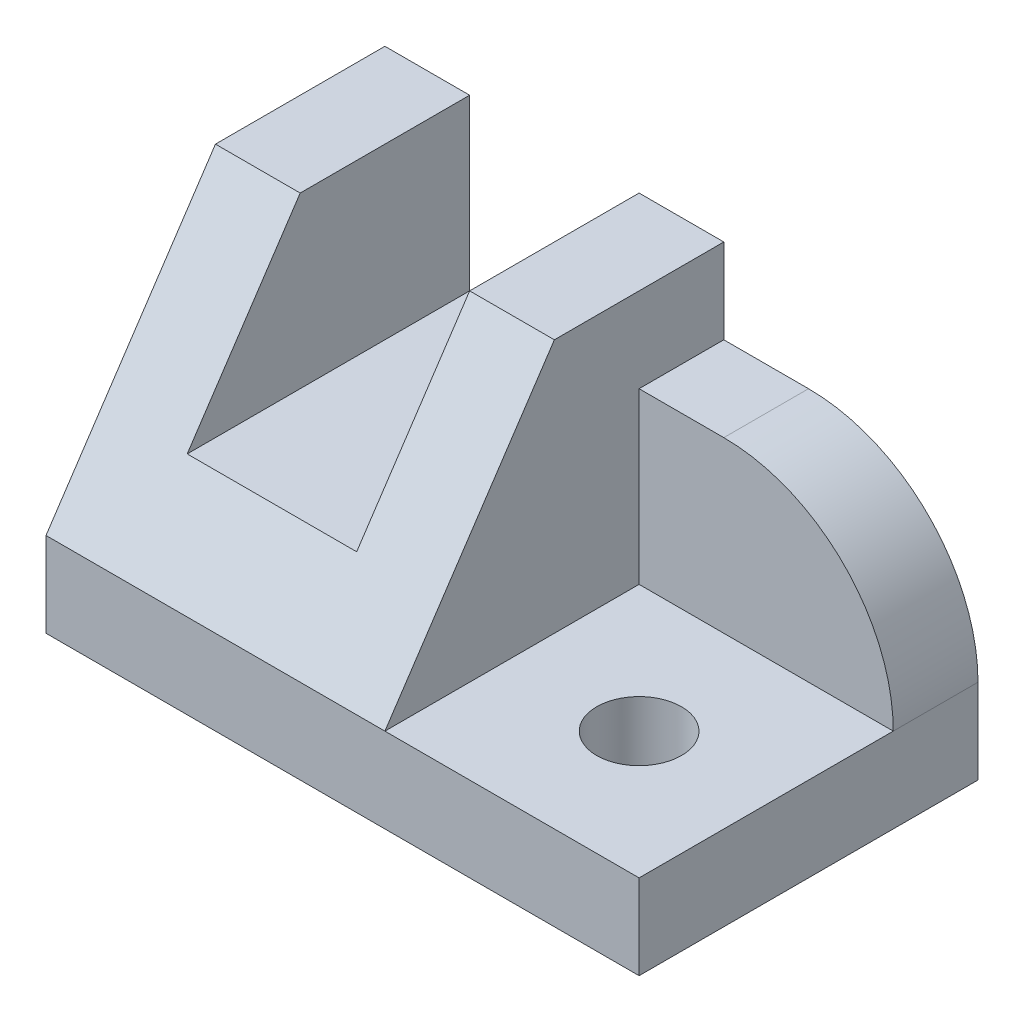
ISO-10303-21;
HEADER;
FILE_DESCRIPTION(('STEP AP214'),'2;1');
FILE_NAME('part.step','',(''),(''),'','','');
FILE_SCHEMA(('AUTOMOTIVE_DESIGN { 1 0 10303 214 1 1 1 1 }'));
ENDSEC;
DATA;
#1=APPLICATION_CONTEXT('core data for automotive mechanical design processes');
#2=APPLICATION_PROTOCOL_DEFINITION('international standard','automotive_design',2000,#1);
#3=PRODUCT_CONTEXT('',#1,'mechanical');
#4=PRODUCT('Part','Part','',(#3));
#5=PRODUCT_RELATED_PRODUCT_CATEGORY('part','',(#4));
#6=PRODUCT_DEFINITION_FORMATION('','',#4);
#7=PRODUCT_DEFINITION_CONTEXT('part definition',#1,'design');
#8=PRODUCT_DEFINITION('design','',#6,#7);
#9=PRODUCT_DEFINITION_SHAPE('','',#8);
#10=(LENGTH_UNIT() NAMED_UNIT(*) SI_UNIT(.MILLI.,.METRE.));
#11=(NAMED_UNIT(*) PLANE_ANGLE_UNIT() SI_UNIT($,.RADIAN.));
#12=(NAMED_UNIT(*) SI_UNIT($,.STERADIAN.) SOLID_ANGLE_UNIT());
#13=UNCERTAINTY_MEASURE_WITH_UNIT(LENGTH_MEASURE(1.E-05),#10,'distance_accuracy_value','');
#14=(GEOMETRIC_REPRESENTATION_CONTEXT(3) GLOBAL_UNCERTAINTY_ASSIGNED_CONTEXT((#13)) GLOBAL_UNIT_ASSIGNED_CONTEXT((#10,
#11,#12)) REPRESENTATION_CONTEXT('',''));
#15=CARTESIAN_POINT('',(0.,0.,0.));
#16=DIRECTION('',(0.,0.,1.));
#17=DIRECTION('',(1.,0.,0.));
#18=AXIS2_PLACEMENT_3D('',#15,#16,#17);
#19=CARTESIAN_POINT('',(40.,40.,-40.));
#20=DIRECTION('',(0.,-1.,0.));
#21=DIRECTION('',(0.,0.,-1.));
#22=AXIS2_PLACEMENT_3D('',#19,#20,#21);
#23=PLANE('',#22);
#24=DIRECTION('',(-1.,0.,0.));
#25=VECTOR('',#24,1.);
#26=CARTESIAN_POINT('',(40.,40.,-20.));
#27=LINE('',#26,#25);
#28=CARTESIAN_POINT('',(9.99999999999998,40.,-20.));
#29=VERTEX_POINT('',#28);
#30=CARTESIAN_POINT('',(0.,40.,-20.));
#31=VERTEX_POINT('',#30);
#32=EDGE_CURVE('E230',#29,#31,#27,.T.);
#33=ORIENTED_EDGE('',*,*,#32,.F.);
#34=DIRECTION('',(0.,0.,-1.));
#35=VECTOR('',#34,1.);
#36=CARTESIAN_POINT('',(9.99999999999998,40.,0.));
#37=LINE('',#36,#35);
#38=CARTESIAN_POINT('',(9.99999999999999,40.,-40.));
#39=VERTEX_POINT('',#38);
#40=EDGE_CURVE('E157',#29,#39,#37,.T.);
#41=ORIENTED_EDGE('',*,*,#40,.T.);
#42=DIRECTION('',(1.,0.,0.));
#43=VECTOR('',#42,1.);
#44=CARTESIAN_POINT('',(40.,40.,-40.));
#45=LINE('',#44,#43);
#46=CARTESIAN_POINT('',(0.,40.,-40.));
#47=VERTEX_POINT('',#46);
#48=EDGE_CURVE('E217',#47,#39,#45,.T.);
#49=ORIENTED_EDGE('',*,*,#48,.F.);
#50=DIRECTION('',(0.,0.,1.));
#51=VECTOR('',#50,1.);
#52=CARTESIAN_POINT('',(0.,40.,-40.));
#53=LINE('',#52,#51);
#54=EDGE_CURVE('E219',#47,#31,#53,.T.);
#55=ORIENTED_EDGE('',*,*,#54,.T.);
#56=EDGE_LOOP('',(#33,#41,#49,#55));
#57=FACE_BOUND('',#56,.T.);
#58=ADVANCED_FACE('F35',(#57),#23,.F.);
#59=CARTESIAN_POINT('',(40.,10.,0.));
#60=DIRECTION('',(0.,0.554700196225229,0.832050294337844));
#61=DIRECTION('',(0.,-0.832050294337844,0.554700196225229));
#62=AXIS2_PLACEMENT_3D('',#59,#60,#61);
#63=PLANE('',#62);
#64=DIRECTION('',(0.,-0.832050294337844,0.554700196225229));
#65=VECTOR('',#64,1.);
#66=CARTESIAN_POINT('',(9.99999999999998,10.,0.));
#67=LINE('',#66,#65);
#68=CARTESIAN_POINT('',(9.99999999999998,20.,-6.66666666666667));
#69=VERTEX_POINT('',#68);
#70=EDGE_CURVE('E165',#29,#69,#67,.T.);
#71=ORIENTED_EDGE('',*,*,#70,.F.);
#72=ORIENTED_EDGE('',*,*,#32,.T.);
#73=DIRECTION('',(0.,0.832050294337844,-0.554700196225229));
#74=VECTOR('',#73,1.);
#75=CARTESIAN_POINT('',(0.,10.,0.));
#76=LINE('',#75,#74);
#77=CARTESIAN_POINT('',(0.,10.,0.));
#78=VERTEX_POINT('',#77);
#79=EDGE_CURVE('E222',#78,#31,#76,.T.);
#80=ORIENTED_EDGE('',*,*,#79,.F.);
#81=DIRECTION('',(-1.,0.,0.));
#82=VECTOR('',#81,1.);
#83=CARTESIAN_POINT('',(40.,10.,0.));
#84=LINE('',#83,#82);
#85=CARTESIAN_POINT('',(40.,10.,0.));
#86=VERTEX_POINT('',#85);
#87=EDGE_CURVE('E225',#86,#78,#84,.T.);
#88=ORIENTED_EDGE('',*,*,#87,.F.);
#89=DIRECTION('',(0.,-0.832050294337844,0.554700196225229));
#90=VECTOR('',#89,1.);
#91=CARTESIAN_POINT('',(40.,40.,-20.));
#92=LINE('',#91,#90);
#93=CARTESIAN_POINT('',(40.,40.,-20.));
#94=VERTEX_POINT('',#93);
#95=EDGE_CURVE('E191',#94,#86,#92,.T.);
#96=ORIENTED_EDGE('',*,*,#95,.F.);
#97=CARTESIAN_POINT('',(30.,40.,-20.));
#98=VERTEX_POINT('',#97);
#99=EDGE_CURVE('E226',#94,#98,#27,.T.);
#100=ORIENTED_EDGE('',*,*,#99,.T.);
#101=DIRECTION('',(0.,0.832050294337844,-0.554700196225229));
#102=VECTOR('',#101,1.);
#103=CARTESIAN_POINT('',(30.,10.,0.));
#104=LINE('',#103,#102);
#105=CARTESIAN_POINT('',(30.,20.,-6.66666666666667));
#106=VERTEX_POINT('',#105);
#107=EDGE_CURVE('E160',#106,#98,#104,.T.);
#108=ORIENTED_EDGE('',*,*,#107,.F.);
#109=DIRECTION('',(1.,0.,0.));
#110=VECTOR('',#109,1.);
#111=CARTESIAN_POINT('',(40.,20.,-6.66666666666667));
#112=LINE('',#111,#110);
#113=EDGE_CURVE('E137',#69,#106,#112,.T.);
#114=ORIENTED_EDGE('',*,*,#113,.F.);
#115=EDGE_LOOP('',(#71,#72,#80,#88,#96,#100,#108,#114));
#116=FACE_BOUND('',#115,.T.);
#117=ADVANCED_FACE('F260',(#116),#63,.T.);
#118=CARTESIAN_POINT('',(0.,0.,0.));
#119=DIRECTION('',(1.,0.,0.));
#120=DIRECTION('',(0.,0.,-1.));
#121=AXIS2_PLACEMENT_3D('',#118,#119,#120);
#122=PLANE('',#121);
#123=DIRECTION('',(0.,1.,0.));
#124=VECTOR('',#123,1.);
#125=CARTESIAN_POINT('',(0.,40.,-40.));
#126=LINE('',#125,#124);
#127=CARTESIAN_POINT('',(0.,0.,-40.));
#128=VERTEX_POINT('',#127);
#129=EDGE_CURVE('E214',#128,#47,#126,.T.);
#130=ORIENTED_EDGE('',*,*,#129,.F.);
#131=DIRECTION('',(0.,0.,-1.));
#132=VECTOR('',#131,1.);
#133=CARTESIAN_POINT('',(0.,0.,-40.));
#134=LINE('',#133,#132);
#135=CARTESIAN_POINT('',(0.,0.,0.));
#136=VERTEX_POINT('',#135);
#137=EDGE_CURVE('E171',#136,#128,#134,.T.);
#138=ORIENTED_EDGE('',*,*,#137,.F.);
#139=DIRECTION('',(0.,1.,0.));
#140=VECTOR('',#139,1.);
#141=CARTESIAN_POINT('',(0.,0.,0.));
#142=LINE('',#141,#140);
#143=EDGE_CURVE('E186',#136,#78,#142,.T.);
#144=ORIENTED_EDGE('',*,*,#143,.T.);
#145=ORIENTED_EDGE('',*,*,#79,.T.);
#146=ORIENTED_EDGE('',*,*,#54,.F.);
#147=EDGE_LOOP('',(#130,#138,#144,#145,#146));
#148=FACE_BOUND('',#147,.T.);
#149=ADVANCED_FACE('F273',(#148),#122,.F.);
#150=CARTESIAN_POINT('',(30.,40.,-40.));
#151=VERTEX_POINT('',#150);
#152=CARTESIAN_POINT('',(40.,40.,-40.));
#153=VERTEX_POINT('',#152);
#154=EDGE_CURVE('E216',#151,#153,#45,.T.);
#155=ORIENTED_EDGE('',*,*,#154,.F.);
#156=DIRECTION('',(0.,0.,-1.));
#157=VECTOR('',#156,1.);
#158=CARTESIAN_POINT('',(30.,40.,0.));
#159=LINE('',#158,#157);
#160=EDGE_CURVE('E141',#98,#151,#159,.T.);
#161=ORIENTED_EDGE('',*,*,#160,.F.);
#162=ORIENTED_EDGE('',*,*,#99,.F.);
#163=DIRECTION('',(0.,0.,1.));
#164=VECTOR('',#163,1.);
#165=CARTESIAN_POINT('',(40.,40.,-40.));
#166=LINE('',#165,#164);
#167=EDGE_CURVE('E189',#153,#94,#166,.T.);
#168=ORIENTED_EDGE('',*,*,#167,.F.);
#169=EDGE_LOOP('',(#155,#161,#162,#168));
#170=FACE_BOUND('',#169,.T.);
#171=ADVANCED_FACE('F257',(#170),#23,.F.);
#172=CARTESIAN_POINT('',(0.,0.,-40.));
#173=DIRECTION('',(0.,0.,1.));
#174=DIRECTION('',(0.,-1.,0.));
#175=AXIS2_PLACEMENT_3D('',#172,#173,#174);
#176=PLANE('',#175);
#177=DIRECTION('',(1.,0.,0.));
#178=VECTOR('',#177,1.);
#179=CARTESIAN_POINT('',(40.,30.,-40.));
#180=LINE('',#179,#178);
#181=CARTESIAN_POINT('',(40.,30.,-40.));
#182=VERTEX_POINT('',#181);
#183=CARTESIAN_POINT('',(50.,30.,-40.));
#184=VERTEX_POINT('',#183);
#185=EDGE_CURVE('E207',#182,#184,#180,.T.);
#186=ORIENTED_EDGE('',*,*,#185,.T.);
#187=CARTESIAN_POINT('',(50.,9.99999999999999,-40.));
#188=DIRECTION('',(0.,0.,1.));
#189=DIRECTION('',(0.,-1.,0.));
#190=AXIS2_PLACEMENT_3D('',#187,#188,#189);
#191=CIRCLE('',#190,20.);
#192=CARTESIAN_POINT('',(70.,10.,-40.));
#193=VERTEX_POINT('',#192);
#194=EDGE_CURVE('E50',#184,#193,#191,.F.);
#195=ORIENTED_EDGE('',*,*,#194,.T.);
#196=DIRECTION('',(0.,1.,0.));
#197=VECTOR('',#196,1.);
#198=CARTESIAN_POINT('',(70.,40.,-40.));
#199=LINE('',#198,#197);
#200=CARTESIAN_POINT('',(70.,0.,-40.));
#201=VERTEX_POINT('',#200);
#202=EDGE_CURVE('E209',#201,#193,#199,.T.);
#203=ORIENTED_EDGE('',*,*,#202,.F.);
#204=DIRECTION('',(1.,0.,0.));
#205=VECTOR('',#204,1.);
#206=CARTESIAN_POINT('',(70.,0.,-40.));
#207=LINE('',#206,#205);
#208=EDGE_CURVE('E175',#128,#201,#207,.T.);
#209=ORIENTED_EDGE('',*,*,#208,.F.);
#210=ORIENTED_EDGE('',*,*,#129,.T.);
#211=ORIENTED_EDGE('',*,*,#48,.T.);
#212=DIRECTION('',(0.,1.,0.));
#213=VECTOR('',#212,1.);
#214=CARTESIAN_POINT('',(9.99999999999999,20.,-40.));
#215=LINE('',#214,#213);
#216=CARTESIAN_POINT('',(9.99999999999999,20.,-40.));
#217=VERTEX_POINT('',#216);
#218=EDGE_CURVE('E152',#217,#39,#215,.T.);
#219=ORIENTED_EDGE('',*,*,#218,.F.);
#220=DIRECTION('',(-1.,0.,0.));
#221=VECTOR('',#220,1.);
#222=CARTESIAN_POINT('',(30.,20.,-40.));
#223=LINE('',#222,#221);
#224=CARTESIAN_POINT('',(30.,20.,-40.));
#225=VERTEX_POINT('',#224);
#226=EDGE_CURVE('E134',#225,#217,#223,.T.);
#227=ORIENTED_EDGE('',*,*,#226,.F.);
#228=DIRECTION('',(0.,-1.,0.));
#229=VECTOR('',#228,1.);
#230=CARTESIAN_POINT('',(30.,40.,-40.));
#231=LINE('',#230,#229);
#232=EDGE_CURVE('E144',#151,#225,#231,.T.);
#233=ORIENTED_EDGE('',*,*,#232,.F.);
#234=ORIENTED_EDGE('',*,*,#154,.T.);
#235=DIRECTION('',(0.,1.,0.));
#236=VECTOR('',#235,1.);
#237=CARTESIAN_POINT('',(40.,30.,-40.));
#238=LINE('',#237,#236);
#239=EDGE_CURVE('E203',#182,#153,#238,.T.);
#240=ORIENTED_EDGE('',*,*,#239,.F.);
#241=EDGE_LOOP('',(#186,#195,#203,#209,#210,#211,#219,#227,#233,#234,#240));
#242=FACE_BOUND('',#241,.T.);
#243=ADVANCED_FACE('F150',(#242),#176,.F.);
#244=CARTESIAN_POINT('',(70.,0.,0.));
#245=DIRECTION('',(-1.,0.,0.));
#246=DIRECTION('',(0.,0.,1.));
#247=AXIS2_PLACEMENT_3D('',#244,#245,#246);
#248=PLANE('',#247);
#249=ORIENTED_EDGE('',*,*,#202,.T.);
#250=DIRECTION('',(0.,0.,-1.));
#251=VECTOR('',#250,1.);
#252=CARTESIAN_POINT('',(70.,9.99999999999999,0.));
#253=LINE('',#252,#251);
#254=CARTESIAN_POINT('',(70.,10.,-30.));
#255=VERTEX_POINT('',#254);
#256=EDGE_CURVE('E43',#193,#255,#253,.F.);
#257=ORIENTED_EDGE('',*,*,#256,.T.);
#258=DIRECTION('',(0.,0.,1.));
#259=VECTOR('',#258,1.);
#260=CARTESIAN_POINT('',(70.,10.,0.));
#261=LINE('',#260,#259);
#262=CARTESIAN_POINT('',(70.,10.,0.));
#263=VERTEX_POINT('',#262);
#264=EDGE_CURVE('E172',#255,#263,#261,.T.);
#265=ORIENTED_EDGE('',*,*,#264,.T.);
#266=DIRECTION('',(0.,1.,0.));
#267=VECTOR('',#266,1.);
#268=CARTESIAN_POINT('',(70.,0.,0.));
#269=LINE('',#268,#267);
#270=CARTESIAN_POINT('',(70.,0.,0.));
#271=VERTEX_POINT('',#270);
#272=EDGE_CURVE('E180',#271,#263,#269,.T.);
#273=ORIENTED_EDGE('',*,*,#272,.F.);
#274=DIRECTION('',(0.,0.,1.));
#275=VECTOR('',#274,1.);
#276=CARTESIAN_POINT('',(70.,0.,0.));
#277=LINE('',#276,#275);
#278=EDGE_CURVE('E178',#201,#271,#277,.T.);
#279=ORIENTED_EDGE('',*,*,#278,.F.);
#280=EDGE_LOOP('',(#249,#257,#265,#273,#279));
#281=FACE_BOUND('',#280,.T.);
#282=ADVANCED_FACE('F237',(#281),#248,.F.);
#283=CARTESIAN_POINT('',(40.,30.,-30.));
#284=DIRECTION('',(0.,-1.,0.));
#285=DIRECTION('',(0.,0.,-1.));
#286=AXIS2_PLACEMENT_3D('',#283,#284,#285);
#287=PLANE('',#286);
#288=DIRECTION('',(1.,0.,0.));
#289=VECTOR('',#288,1.);
#290=CARTESIAN_POINT('',(40.,30.,-30.));
#291=LINE('',#290,#289);
#292=CARTESIAN_POINT('',(40.,30.,-30.));
#293=VERTEX_POINT('',#292);
#294=CARTESIAN_POINT('',(50.,30.,-30.));
#295=VERTEX_POINT('',#294);
#296=EDGE_CURVE('E210',#293,#295,#291,.T.);
#297=ORIENTED_EDGE('',*,*,#296,.T.);
#298=DIRECTION('',(0.,0.,-1.));
#299=VECTOR('',#298,1.);
#300=CARTESIAN_POINT('',(50.,30.,-30.));
#301=LINE('',#300,#299);
#302=EDGE_CURVE('E229',#295,#184,#301,.T.);
#303=ORIENTED_EDGE('',*,*,#302,.T.);
#304=ORIENTED_EDGE('',*,*,#185,.F.);
#305=DIRECTION('',(0.,0.,-1.));
#306=VECTOR('',#305,1.);
#307=CARTESIAN_POINT('',(40.,30.,-30.));
#308=LINE('',#307,#306);
#309=EDGE_CURVE('E200',#293,#182,#308,.T.);
#310=ORIENTED_EDGE('',*,*,#309,.F.);
#311=EDGE_LOOP('',(#297,#303,#304,#310));
#312=FACE_BOUND('',#311,.T.);
#313=ADVANCED_FACE('F248',(#312),#287,.F.);
#314=CARTESIAN_POINT('',(40.,10.,-30.));
#315=DIRECTION('',(0.,0.,-1.));
#316=DIRECTION('',(-1.,0.,0.));
#317=AXIS2_PLACEMENT_3D('',#314,#315,#316);
#318=PLANE('',#317);
#319=DIRECTION('',(1.,0.,0.));
#320=VECTOR('',#319,1.);
#321=CARTESIAN_POINT('',(40.,10.,-30.));
#322=LINE('',#321,#320);
#323=CARTESIAN_POINT('',(40.,10.,-30.));
#324=VERTEX_POINT('',#323);
#325=EDGE_CURVE('E206',#324,#255,#322,.T.);
#326=ORIENTED_EDGE('',*,*,#325,.T.);
#327=CARTESIAN_POINT('',(50.,9.99999999999999,-30.));
#328=DIRECTION('',(0.,0.,-1.));
#329=DIRECTION('',(-1.,0.,0.));
#330=AXIS2_PLACEMENT_3D('',#327,#328,#329);
#331=CIRCLE('',#330,20.);
#332=EDGE_CURVE('E11',#255,#295,#331,.F.);
#333=ORIENTED_EDGE('',*,*,#332,.T.);
#334=ORIENTED_EDGE('',*,*,#296,.F.);
#335=DIRECTION('',(0.,1.,0.));
#336=VECTOR('',#335,1.);
#337=CARTESIAN_POINT('',(40.,10.,-30.));
#338=LINE('',#337,#336);
#339=EDGE_CURVE('E197',#324,#293,#338,.T.);
#340=ORIENTED_EDGE('',*,*,#339,.F.);
#341=EDGE_LOOP('',(#326,#333,#334,#340));
#342=FACE_BOUND('',#341,.T.);
#343=ADVANCED_FACE('F245',(#342),#318,.F.);
#344=CARTESIAN_POINT('',(40.,0.,0.));
#345=DIRECTION('',(-1.,0.,0.));
#346=DIRECTION('',(0.,0.,1.));
#347=AXIS2_PLACEMENT_3D('',#344,#345,#346);
#348=PLANE('',#347);
#349=ORIENTED_EDGE('',*,*,#167,.T.);
#350=ORIENTED_EDGE('',*,*,#95,.T.);
#351=DIRECTION('',(0.,0.,-1.));
#352=VECTOR('',#351,1.);
#353=CARTESIAN_POINT('',(40.,10.,0.));
#354=LINE('',#353,#352);
#355=EDGE_CURVE('E194',#86,#324,#354,.T.);
#356=ORIENTED_EDGE('',*,*,#355,.T.);
#357=ORIENTED_EDGE('',*,*,#339,.T.);
#358=ORIENTED_EDGE('',*,*,#309,.T.);
#359=ORIENTED_EDGE('',*,*,#239,.T.);
#360=EDGE_LOOP('',(#349,#350,#356,#357,#358,#359));
#361=FACE_BOUND('',#360,.T.);
#362=ADVANCED_FACE('F253',(#361),#348,.F.);
#363=CARTESIAN_POINT('',(0.,10.,0.));
#364=DIRECTION('',(0.,1.,0.));
#365=DIRECTION('',(0.,0.,1.));
#366=AXIS2_PLACEMENT_3D('',#363,#364,#365);
#367=PLANE('',#366);
#368=CARTESIAN_POINT('',(55.,10.,-15.));
#369=DIRECTION('',(0.,1.,0.));
#370=DIRECTION('',(0.,0.,1.));
#371=AXIS2_PLACEMENT_3D('',#368,#369,#370);
#372=CIRCLE('',#371,4.99999999999998);
#373=CARTESIAN_POINT('',(55.,10.,-10.));
#374=VERTEX_POINT('',#373);
#375=EDGE_CURVE('E148',#374,#374,#372,.T.);
#376=ORIENTED_EDGE('',*,*,#375,.F.);
#377=EDGE_LOOP('',(#376));
#378=FACE_BOUND('',#377,.T.);
#379=ORIENTED_EDGE('',*,*,#325,.F.);
#380=ORIENTED_EDGE('',*,*,#355,.F.);
#381=DIRECTION('',(-1.,0.,0.));
#382=VECTOR('',#381,1.);
#383=CARTESIAN_POINT('',(0.,10.,0.));
#384=LINE('',#383,#382);
#385=EDGE_CURVE('E167',#263,#86,#384,.T.);
#386=ORIENTED_EDGE('',*,*,#385,.F.);
#387=ORIENTED_EDGE('',*,*,#264,.F.);
#388=EDGE_LOOP('',(#379,#380,#386,#387));
#389=FACE_BOUND('',#388,.T.);
#390=ADVANCED_FACE('F243',(#378,#389),#367,.T.);
#391=CARTESIAN_POINT('',(0.,0.,0.));
#392=DIRECTION('',(0.,0.,-1.));
#393=DIRECTION('',(-1.,0.,0.));
#394=AXIS2_PLACEMENT_3D('',#391,#392,#393);
#395=PLANE('',#394);
#396=ORIENTED_EDGE('',*,*,#385,.T.);
#397=ORIENTED_EDGE('',*,*,#87,.T.);
#398=ORIENTED_EDGE('',*,*,#143,.F.);
#399=DIRECTION('',(-1.,0.,0.));
#400=VECTOR('',#399,1.);
#401=CARTESIAN_POINT('',(0.,0.,0.));
#402=LINE('',#401,#400);
#403=EDGE_CURVE('E168',#271,#136,#402,.T.);
#404=ORIENTED_EDGE('',*,*,#403,.F.);
#405=ORIENTED_EDGE('',*,*,#272,.T.);
#406=EDGE_LOOP('',(#396,#397,#398,#404,#405));
#407=FACE_BOUND('',#406,.T.);
#408=ADVANCED_FACE('F264',(#407),#395,.F.);
#409=CARTESIAN_POINT('',(0.,0.,0.));
#410=DIRECTION('',(0.,1.,0.));
#411=DIRECTION('',(0.,0.,1.));
#412=AXIS2_PLACEMENT_3D('',#409,#410,#411);
#413=PLANE('',#412);
#414=CARTESIAN_POINT('',(55.,0.,-15.));
#415=DIRECTION('',(0.,-1.,0.));
#416=DIRECTION('',(0.,0.,-1.));
#417=AXIS2_PLACEMENT_3D('',#414,#415,#416);
#418=CIRCLE('',#417,4.99999999999998);
#419=CARTESIAN_POINT('',(55.,0.,-20.));
#420=VERTEX_POINT('',#419);
#421=EDGE_CURVE('E437',#420,#420,#418,.T.);
#422=ORIENTED_EDGE('',*,*,#421,.F.);
#423=EDGE_LOOP('',(#422));
#424=FACE_BOUND('',#423,.T.);
#425=ORIENTED_EDGE('',*,*,#403,.T.);
#426=ORIENTED_EDGE('',*,*,#137,.T.);
#427=ORIENTED_EDGE('',*,*,#208,.T.);
#428=ORIENTED_EDGE('',*,*,#278,.T.);
#429=EDGE_LOOP('',(#425,#426,#427,#428));
#430=FACE_BOUND('',#429,.T.);
#431=ADVANCED_FACE('F268',(#424,#430),#413,.F.);
#432=CARTESIAN_POINT('',(9.99999999999998,20.,0.));
#433=DIRECTION('',(-1.,0.,0.));
#434=DIRECTION('',(0.,0.,1.));
#435=AXIS2_PLACEMENT_3D('',#432,#433,#434);
#436=PLANE('',#435);
#437=ORIENTED_EDGE('',*,*,#70,.T.);
#438=DIRECTION('',(0.,0.,-1.));
#439=VECTOR('',#438,1.);
#440=CARTESIAN_POINT('',(9.99999999999998,20.,0.));
#441=LINE('',#440,#439);
#442=EDGE_CURVE('E140',#69,#217,#441,.T.);
#443=ORIENTED_EDGE('',*,*,#442,.T.);
#444=ORIENTED_EDGE('',*,*,#218,.T.);
#445=ORIENTED_EDGE('',*,*,#40,.F.);
#446=EDGE_LOOP('',(#437,#443,#444,#445));
#447=FACE_BOUND('',#446,.T.);
#448=ADVANCED_FACE('F277',(#447),#436,.F.);
#449=CARTESIAN_POINT('',(30.,20.,0.));
#450=DIRECTION('',(0.,-1.,0.));
#451=DIRECTION('',(0.,0.,-1.));
#452=AXIS2_PLACEMENT_3D('',#449,#450,#451);
#453=PLANE('',#452);
#454=ORIENTED_EDGE('',*,*,#113,.T.);
#455=DIRECTION('',(0.,0.,-1.));
#456=VECTOR('',#455,1.);
#457=CARTESIAN_POINT('',(30.,20.,0.));
#458=LINE('',#457,#456);
#459=EDGE_CURVE('E129',#106,#225,#458,.T.);
#460=ORIENTED_EDGE('',*,*,#459,.T.);
#461=ORIENTED_EDGE('',*,*,#226,.T.);
#462=ORIENTED_EDGE('',*,*,#442,.F.);
#463=EDGE_LOOP('',(#454,#460,#461,#462));
#464=FACE_BOUND('',#463,.T.);
#465=ADVANCED_FACE('F131',(#464),#453,.F.);
#466=CARTESIAN_POINT('',(30.,40.,0.));
#467=DIRECTION('',(1.,0.,0.));
#468=DIRECTION('',(0.,0.,-1.));
#469=AXIS2_PLACEMENT_3D('',#466,#467,#468);
#470=PLANE('',#469);
#471=ORIENTED_EDGE('',*,*,#107,.T.);
#472=ORIENTED_EDGE('',*,*,#160,.T.);
#473=ORIENTED_EDGE('',*,*,#232,.T.);
#474=ORIENTED_EDGE('',*,*,#459,.F.);
#475=EDGE_LOOP('',(#471,#472,#473,#474));
#476=FACE_BOUND('',#475,.T.);
#477=ADVANCED_FACE('F145',(#476),#470,.F.);
#478=CARTESIAN_POINT('',(55.,0.,-15.));
#479=DIRECTION('',(0.,-1.,0.));
#480=DIRECTION('',(0.,0.,-1.));
#481=AXIS2_PLACEMENT_3D('',#478,#479,#480);
#482=CYLINDRICAL_SURFACE('',#481,4.99999999999998);
#483=ORIENTED_EDGE('',*,*,#375,.T.);
#484=EDGE_LOOP('',(#483));
#485=FACE_BOUND('',#484,.T.);
#486=ORIENTED_EDGE('',*,*,#421,.T.);
#487=EDGE_LOOP('',(#486));
#488=FACE_BOUND('',#487,.T.);
#489=ADVANCED_FACE('F337',(#485,#488),#482,.F.);
#490=CARTESIAN_POINT('',(50.,9.99999999999999,-30.));
#491=DIRECTION('',(0.,0.,-1.));
#492=DIRECTION('',(-1.,0.,0.));
#493=AXIS2_PLACEMENT_3D('',#490,#491,#492);
#494=CYLINDRICAL_SURFACE('',#493,20.);
#495=ORIENTED_EDGE('',*,*,#332,.F.);
#496=ORIENTED_EDGE('',*,*,#256,.F.);
#497=ORIENTED_EDGE('',*,*,#194,.F.);
#498=ORIENTED_EDGE('',*,*,#302,.F.);
#499=EDGE_LOOP('',(#495,#496,#497,#498));
#500=FACE_BOUND('',#499,.T.);
#501=ADVANCED_FACE('F37',(#500),#494,.T.);
#502=CLOSED_SHELL('',(#58,#117,#149,#171,#243,#282,#313,#343,#362,#390,#408,#431,#448,#465,#477,
#489,#501));
#503=MANIFOLD_SOLID_BREP('B2',#502);
#504=ADVANCED_BREP_SHAPE_REPRESENTATION('',(#18,#503),#14);
#505=SHAPE_DEFINITION_REPRESENTATION(#9,#504);
ENDSEC;
END-ISO-10303-21;
